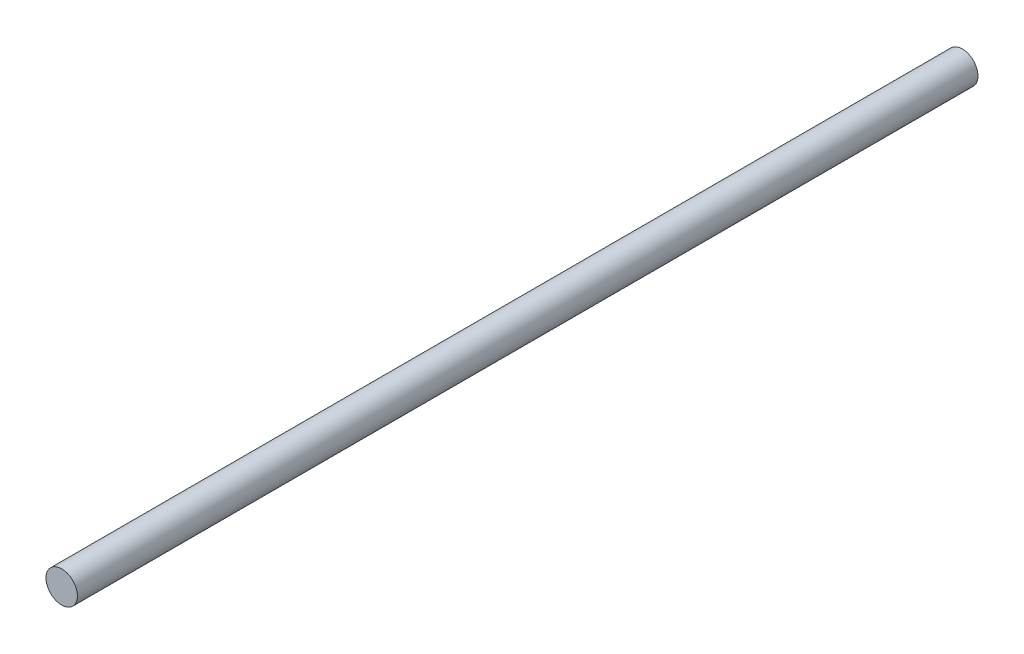
ISO-10303-21;
HEADER;
FILE_DESCRIPTION(('STEP AP214'),'2;1');
FILE_NAME('part.step','',(''),(''),'','','');
FILE_SCHEMA(('AUTOMOTIVE_DESIGN { 1 0 10303 214 1 1 1 1 }'));
ENDSEC;
DATA;
#1=APPLICATION_CONTEXT('core data for automotive mechanical design processes');
#2=APPLICATION_PROTOCOL_DEFINITION('international standard','automotive_design',2000,#1);
#3=PRODUCT_CONTEXT('',#1,'mechanical');
#4=PRODUCT('Part','Part','',(#3));
#5=PRODUCT_RELATED_PRODUCT_CATEGORY('part','',(#4));
#6=PRODUCT_DEFINITION_FORMATION('','',#4);
#7=PRODUCT_DEFINITION_CONTEXT('part definition',#1,'design');
#8=PRODUCT_DEFINITION('design','',#6,#7);
#9=PRODUCT_DEFINITION_SHAPE('','',#8);
#10=(LENGTH_UNIT() NAMED_UNIT(*) SI_UNIT(.MILLI.,.METRE.));
#11=(NAMED_UNIT(*) PLANE_ANGLE_UNIT() SI_UNIT($,.RADIAN.));
#12=(NAMED_UNIT(*) SI_UNIT($,.STERADIAN.) SOLID_ANGLE_UNIT());
#13=UNCERTAINTY_MEASURE_WITH_UNIT(LENGTH_MEASURE(1.E-05),#10,'distance_accuracy_value','');
#14=(GEOMETRIC_REPRESENTATION_CONTEXT(3) GLOBAL_UNCERTAINTY_ASSIGNED_CONTEXT((#13)) GLOBAL_UNIT_ASSIGNED_CONTEXT((#10,
#11,#12)) REPRESENTATION_CONTEXT('',''));
#15=CARTESIAN_POINT('',(0.,0.,0.));
#16=DIRECTION('',(0.,0.,1.));
#17=DIRECTION('',(1.,0.,0.));
#18=AXIS2_PLACEMENT_3D('',#15,#16,#17);
#19=CARTESIAN_POINT('',(0.,0.,172.));
#20=DIRECTION('',(0.,0.,-1.));
#21=DIRECTION('',(-1.,0.,0.));
#22=AXIS2_PLACEMENT_3D('',#19,#20,#21);
#23=CYLINDRICAL_SURFACE('',#22,3.);
#24=CARTESIAN_POINT('',(0.,0.,172.));
#25=DIRECTION('',(0.,0.,1.));
#26=DIRECTION('',(1.,0.,0.));
#27=AXIS2_PLACEMENT_3D('',#24,#25,#26);
#28=CIRCLE('',#27,3.);
#29=CARTESIAN_POINT('',(3.,0.,172.));
#30=VERTEX_POINT('',#29);
#31=EDGE_CURVE('E10',#30,#30,#28,.T.);
#32=ORIENTED_EDGE('',*,*,#31,.F.);
#33=EDGE_LOOP('',(#32));
#34=FACE_BOUND('',#33,.T.);
#35=CARTESIAN_POINT('',(0.,0.,0.));
#36=DIRECTION('',(0.,0.,1.));
#37=DIRECTION('',(1.,0.,0.));
#38=AXIS2_PLACEMENT_3D('',#35,#36,#37);
#39=CIRCLE('',#38,3.);
#40=CARTESIAN_POINT('',(3.,0.,0.));
#41=VERTEX_POINT('',#40);
#42=EDGE_CURVE('E38',#41,#41,#39,.T.);
#43=ORIENTED_EDGE('',*,*,#42,.T.);
#44=EDGE_LOOP('',(#43));
#45=FACE_BOUND('',#44,.T.);
#46=ADVANCED_FACE('F35',(#34,#45),#23,.T.);
#47=CARTESIAN_POINT('',(0.,0.,172.));
#48=DIRECTION('',(0.,0.,1.));
#49=DIRECTION('',(1.,0.,0.));
#50=AXIS2_PLACEMENT_3D('',#47,#48,#49);
#51=PLANE('',#50);
#52=ORIENTED_EDGE('',*,*,#31,.T.);
#53=EDGE_LOOP('',(#52));
#54=FACE_BOUND('',#53,.T.);
#55=ADVANCED_FACE('F50',(#54),#51,.T.);
#56=CARTESIAN_POINT('',(0.,0.,0.));
#57=DIRECTION('',(0.,0.,1.));
#58=DIRECTION('',(1.,0.,0.));
#59=AXIS2_PLACEMENT_3D('',#56,#57,#58);
#60=PLANE('',#59);
#61=ORIENTED_EDGE('',*,*,#42,.F.);
#62=EDGE_LOOP('',(#61));
#63=FACE_BOUND('',#62,.T.);
#64=ADVANCED_FACE('F48',(#63),#60,.F.);
#65=CLOSED_SHELL('',(#46,#55,#64));
#66=MANIFOLD_SOLID_BREP('B2',#65);
#67=ADVANCED_BREP_SHAPE_REPRESENTATION('',(#18,#66),#14);
#68=SHAPE_DEFINITION_REPRESENTATION(#9,#67);
ENDSEC;
END-ISO-10303-21;
